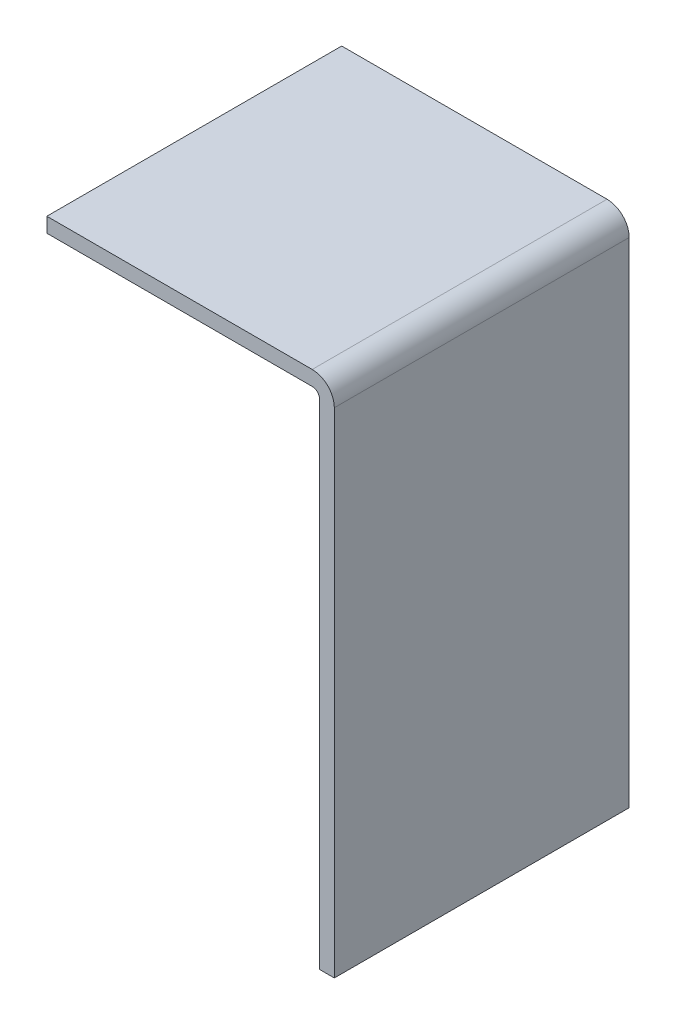
ISO-10303-21;
HEADER;
FILE_DESCRIPTION(('STEP AP214'),'2;1');
FILE_NAME('part.step','',(''),(''),'','','');
FILE_SCHEMA(('AUTOMOTIVE_DESIGN { 1 0 10303 214 1 1 1 1 }'));
ENDSEC;
DATA;
#1=APPLICATION_CONTEXT('core data for automotive mechanical design processes');
#2=APPLICATION_PROTOCOL_DEFINITION('international standard','automotive_design',2000,#1);
#3=PRODUCT_CONTEXT('',#1,'mechanical');
#4=PRODUCT('Part','Part','',(#3));
#5=PRODUCT_RELATED_PRODUCT_CATEGORY('part','',(#4));
#6=PRODUCT_DEFINITION_FORMATION('','',#4);
#7=PRODUCT_DEFINITION_CONTEXT('part definition',#1,'design');
#8=PRODUCT_DEFINITION('design','',#6,#7);
#9=PRODUCT_DEFINITION_SHAPE('','',#8);
#10=(LENGTH_UNIT() NAMED_UNIT(*) SI_UNIT(.MILLI.,.METRE.));
#11=(NAMED_UNIT(*) PLANE_ANGLE_UNIT() SI_UNIT($,.RADIAN.));
#12=(NAMED_UNIT(*) SI_UNIT($,.STERADIAN.) SOLID_ANGLE_UNIT());
#13=UNCERTAINTY_MEASURE_WITH_UNIT(LENGTH_MEASURE(1.E-05),#10,'distance_accuracy_value','');
#14=(GEOMETRIC_REPRESENTATION_CONTEXT(3) GLOBAL_UNCERTAINTY_ASSIGNED_CONTEXT((#13)) GLOBAL_UNIT_ASSIGNED_CONTEXT((#10,
#11,#12)) REPRESENTATION_CONTEXT('',''));
#15=CARTESIAN_POINT('',(0.,0.,0.));
#16=DIRECTION('',(0.,0.,1.));
#17=DIRECTION('',(1.,0.,0.));
#18=AXIS2_PLACEMENT_3D('',#15,#16,#17);
#19=CARTESIAN_POINT('',(-39.,0.,40.));
#20=DIRECTION('',(1.,0.,0.));
#21=DIRECTION('',(0.,0.,-1.));
#22=AXIS2_PLACEMENT_3D('',#19,#20,#21);
#23=PLANE('',#22);
#24=DIRECTION('',(0.,-1.,0.));
#25=VECTOR('',#24,1.);
#26=CARTESIAN_POINT('',(-39.,0.,0.));
#27=LINE('',#26,#25);
#28=CARTESIAN_POINT('',(-39.,0.,0.));
#29=VERTEX_POINT('',#28);
#30=CARTESIAN_POINT('',(-39.,-2.,0.));
#31=VERTEX_POINT('',#30);
#32=EDGE_CURVE('E127',#29,#31,#27,.T.);
#33=ORIENTED_EDGE('',*,*,#32,.T.);
#34=DIRECTION('',(0.,0.,-1.));
#35=VECTOR('',#34,1.);
#36=CARTESIAN_POINT('',(-39.,-2.,40.));
#37=LINE('',#36,#35);
#38=CARTESIAN_POINT('',(-39.,-2.,40.));
#39=VERTEX_POINT('',#38);
#40=EDGE_CURVE('E11',#39,#31,#37,.T.);
#41=ORIENTED_EDGE('',*,*,#40,.F.);
#42=DIRECTION('',(0.,-1.,0.));
#43=VECTOR('',#42,1.);
#44=CARTESIAN_POINT('',(-39.,0.,40.));
#45=LINE('',#44,#43);
#46=CARTESIAN_POINT('',(-39.,0.,40.));
#47=VERTEX_POINT('',#46);
#48=EDGE_CURVE('E141',#47,#39,#45,.T.);
#49=ORIENTED_EDGE('',*,*,#48,.F.);
#50=DIRECTION('',(0.,0.,-1.));
#51=VECTOR('',#50,1.);
#52=CARTESIAN_POINT('',(-39.,0.,40.));
#53=LINE('',#52,#51);
#54=EDGE_CURVE('E123',#47,#29,#53,.T.);
#55=ORIENTED_EDGE('',*,*,#54,.T.);
#56=EDGE_LOOP('',(#33,#41,#49,#55));
#57=FACE_BOUND('',#56,.T.);
#58=ADVANCED_FACE('F31',(#57),#23,.F.);
#59=CARTESIAN_POINT('',(-3.00000000000001,-2.,40.));
#60=DIRECTION('',(0.,1.,0.));
#61=DIRECTION('',(0.,0.,1.));
#62=AXIS2_PLACEMENT_3D('',#59,#60,#61);
#63=PLANE('',#62);
#64=DIRECTION('',(1.,0.,0.));
#65=VECTOR('',#64,1.);
#66=CARTESIAN_POINT('',(-3.00000000000001,-2.,0.));
#67=LINE('',#66,#65);
#68=CARTESIAN_POINT('',(-3.00000000000001,-2.,0.));
#69=VERTEX_POINT('',#68);
#70=EDGE_CURVE('E130',#31,#69,#67,.T.);
#71=ORIENTED_EDGE('',*,*,#70,.T.);
#72=DIRECTION('',(0.,0.,-1.));
#73=VECTOR('',#72,1.);
#74=CARTESIAN_POINT('',(-3.00000000000001,-2.,40.));
#75=LINE('',#74,#73);
#76=CARTESIAN_POINT('',(-3.00000000000001,-2.,40.));
#77=VERTEX_POINT('',#76);
#78=EDGE_CURVE('E39',#77,#69,#75,.T.);
#79=ORIENTED_EDGE('',*,*,#78,.F.);
#80=DIRECTION('',(1.,0.,0.));
#81=VECTOR('',#80,1.);
#82=CARTESIAN_POINT('',(-3.00000000000001,-2.,40.));
#83=LINE('',#82,#81);
#84=EDGE_CURVE('E90',#39,#77,#83,.T.);
#85=ORIENTED_EDGE('',*,*,#84,.F.);
#86=ORIENTED_EDGE('',*,*,#40,.T.);
#87=EDGE_LOOP('',(#71,#79,#85,#86));
#88=FACE_BOUND('',#87,.T.);
#89=ADVANCED_FACE('F176',(#88),#63,.F.);
#90=CARTESIAN_POINT('',(-3.,-3.,40.));
#91=DIRECTION('',(0.,0.,-1.));
#92=DIRECTION('',(-1.,0.,0.));
#93=AXIS2_PLACEMENT_3D('',#90,#91,#92);
#94=CYLINDRICAL_SURFACE('',#93,1.);
#95=CARTESIAN_POINT('',(-3.,-3.,0.));
#96=DIRECTION('',(0.,0.,-1.));
#97=DIRECTION('',(-1.,0.,0.));
#98=AXIS2_PLACEMENT_3D('',#95,#96,#97);
#99=CIRCLE('',#98,1.);
#100=CARTESIAN_POINT('',(-2.,-3.00000000000001,0.));
#101=VERTEX_POINT('',#100);
#102=EDGE_CURVE('E132',#69,#101,#99,.T.);
#103=ORIENTED_EDGE('',*,*,#102,.T.);
#104=DIRECTION('',(0.,0.,-1.));
#105=VECTOR('',#104,1.);
#106=CARTESIAN_POINT('',(-2.,-3.00000000000001,40.));
#107=LINE('',#106,#105);
#108=CARTESIAN_POINT('',(-2.,-3.00000000000001,40.));
#109=VERTEX_POINT('',#108);
#110=EDGE_CURVE('E148',#109,#101,#107,.T.);
#111=ORIENTED_EDGE('',*,*,#110,.F.);
#112=CARTESIAN_POINT('',(-3.,-3.,40.));
#113=DIRECTION('',(0.,0.,-1.));
#114=DIRECTION('',(-1.,0.,0.));
#115=AXIS2_PLACEMENT_3D('',#112,#113,#114);
#116=CIRCLE('',#115,1.);
#117=EDGE_CURVE('E156',#77,#109,#116,.T.);
#118=ORIENTED_EDGE('',*,*,#117,.F.);
#119=ORIENTED_EDGE('',*,*,#78,.T.);
#120=EDGE_LOOP('',(#103,#111,#118,#119));
#121=FACE_BOUND('',#120,.T.);
#122=ADVANCED_FACE('F154',(#121),#94,.F.);
#123=CARTESIAN_POINT('',(-2.,-3.00000000000001,40.));
#124=DIRECTION('',(1.,0.,0.));
#125=DIRECTION('',(0.,0.,-1.));
#126=AXIS2_PLACEMENT_3D('',#123,#124,#125);
#127=PLANE('',#126);
#128=DIRECTION('',(0.,-1.,0.));
#129=VECTOR('',#128,1.);
#130=CARTESIAN_POINT('',(-2.,-3.00000000000001,0.));
#131=LINE('',#130,#129);
#132=CARTESIAN_POINT('',(-2.,-70.,0.));
#133=VERTEX_POINT('',#132);
#134=EDGE_CURVE('E134',#101,#133,#131,.T.);
#135=ORIENTED_EDGE('',*,*,#134,.T.);
#136=DIRECTION('',(0.,0.,-1.));
#137=VECTOR('',#136,1.);
#138=CARTESIAN_POINT('',(-2.,-70.,40.));
#139=LINE('',#138,#137);
#140=CARTESIAN_POINT('',(-2.,-70.,40.));
#141=VERTEX_POINT('',#140);
#142=EDGE_CURVE('E145',#141,#133,#139,.T.);
#143=ORIENTED_EDGE('',*,*,#142,.F.);
#144=DIRECTION('',(0.,-1.,0.));
#145=VECTOR('',#144,1.);
#146=CARTESIAN_POINT('',(-2.,-3.00000000000001,40.));
#147=LINE('',#146,#145);
#148=EDGE_CURVE('E168',#109,#141,#147,.T.);
#149=ORIENTED_EDGE('',*,*,#148,.F.);
#150=ORIENTED_EDGE('',*,*,#110,.T.);
#151=EDGE_LOOP('',(#135,#143,#149,#150));
#152=FACE_BOUND('',#151,.T.);
#153=ADVANCED_FACE('F164',(#152),#127,.F.);
#154=CARTESIAN_POINT('',(-2.,-70.,40.));
#155=DIRECTION('',(0.,1.,0.));
#156=DIRECTION('',(0.,0.,1.));
#157=AXIS2_PLACEMENT_3D('',#154,#155,#156);
#158=PLANE('',#157);
#159=DIRECTION('',(1.,0.,0.));
#160=VECTOR('',#159,1.);
#161=CARTESIAN_POINT('',(-2.,-70.,0.));
#162=LINE('',#161,#160);
#163=CARTESIAN_POINT('',(0.,-70.,0.));
#164=VERTEX_POINT('',#163);
#165=EDGE_CURVE('E136',#133,#164,#162,.T.);
#166=ORIENTED_EDGE('',*,*,#165,.T.);
#167=DIRECTION('',(0.,0.,-1.));
#168=VECTOR('',#167,1.);
#169=CARTESIAN_POINT('',(0.,-70.,40.));
#170=LINE('',#169,#168);
#171=CARTESIAN_POINT('',(0.,-70.,40.));
#172=VERTEX_POINT('',#171);
#173=EDGE_CURVE('E118',#172,#164,#170,.T.);
#174=ORIENTED_EDGE('',*,*,#173,.F.);
#175=DIRECTION('',(1.,0.,0.));
#176=VECTOR('',#175,1.);
#177=CARTESIAN_POINT('',(-2.,-70.,40.));
#178=LINE('',#177,#176);
#179=EDGE_CURVE('E109',#141,#172,#178,.T.);
#180=ORIENTED_EDGE('',*,*,#179,.F.);
#181=ORIENTED_EDGE('',*,*,#142,.T.);
#182=EDGE_LOOP('',(#166,#174,#180,#181));
#183=FACE_BOUND('',#182,.T.);
#184=ADVANCED_FACE('F167',(#183),#158,.F.);
#185=CARTESIAN_POINT('',(0.,-3.00000000000002,40.));
#186=DIRECTION('',(-1.,0.,0.));
#187=DIRECTION('',(0.,-1.,0.));
#188=AXIS2_PLACEMENT_3D('',#185,#186,#187);
#189=PLANE('',#188);
#190=DIRECTION('',(0.,1.,0.));
#191=VECTOR('',#190,1.);
#192=CARTESIAN_POINT('',(0.,-3.00000000000002,0.));
#193=LINE('',#192,#191);
#194=CARTESIAN_POINT('',(0.,-3.00000000000002,0.));
#195=VERTEX_POINT('',#194);
#196=EDGE_CURVE('E117',#164,#195,#193,.T.);
#197=ORIENTED_EDGE('',*,*,#196,.T.);
#198=DIRECTION('',(0.,0.,-1.));
#199=VECTOR('',#198,1.);
#200=CARTESIAN_POINT('',(0.,-3.00000000000002,40.));
#201=LINE('',#200,#199);
#202=CARTESIAN_POINT('',(0.,-3.00000000000002,40.));
#203=VERTEX_POINT('',#202);
#204=EDGE_CURVE('E114',#203,#195,#201,.T.);
#205=ORIENTED_EDGE('',*,*,#204,.F.);
#206=DIRECTION('',(0.,1.,0.));
#207=VECTOR('',#206,1.);
#208=CARTESIAN_POINT('',(0.,-3.00000000000002,40.));
#209=LINE('',#208,#207);
#210=EDGE_CURVE('E103',#172,#203,#209,.T.);
#211=ORIENTED_EDGE('',*,*,#210,.F.);
#212=ORIENTED_EDGE('',*,*,#173,.T.);
#213=EDGE_LOOP('',(#197,#205,#211,#212));
#214=FACE_BOUND('',#213,.T.);
#215=ADVANCED_FACE('F115',(#214),#189,.F.);
#216=CARTESIAN_POINT('',(-3.,-3.,40.));
#217=DIRECTION('',(0.,0.,-1.));
#218=DIRECTION('',(-1.,0.,0.));
#219=AXIS2_PLACEMENT_3D('',#216,#217,#218);
#220=CYLINDRICAL_SURFACE('',#219,3.);
#221=CARTESIAN_POINT('',(-3.,-3.,0.));
#222=DIRECTION('',(0.,0.,1.));
#223=DIRECTION('',(1.,0.,0.));
#224=AXIS2_PLACEMENT_3D('',#221,#222,#223);
#225=CIRCLE('',#224,3.);
#226=CARTESIAN_POINT('',(-3.00000000000002,0.,0.));
#227=VERTEX_POINT('',#226);
#228=EDGE_CURVE('E76',#195,#227,#225,.T.);
#229=ORIENTED_EDGE('',*,*,#228,.T.);
#230=DIRECTION('',(0.,0.,-1.));
#231=VECTOR('',#230,1.);
#232=CARTESIAN_POINT('',(-3.00000000000002,0.,40.));
#233=LINE('',#232,#231);
#234=CARTESIAN_POINT('',(-3.00000000000002,0.,40.));
#235=VERTEX_POINT('',#234);
#236=EDGE_CURVE('E119',#235,#227,#233,.T.);
#237=ORIENTED_EDGE('',*,*,#236,.F.);
#238=CARTESIAN_POINT('',(-3.,-3.,40.));
#239=DIRECTION('',(0.,0.,1.));
#240=DIRECTION('',(1.,0.,0.));
#241=AXIS2_PLACEMENT_3D('',#238,#239,#240);
#242=CIRCLE('',#241,3.);
#243=EDGE_CURVE('E107',#203,#235,#242,.T.);
#244=ORIENTED_EDGE('',*,*,#243,.F.);
#245=ORIENTED_EDGE('',*,*,#204,.T.);
#246=EDGE_LOOP('',(#229,#237,#244,#245));
#247=FACE_BOUND('',#246,.T.);
#248=ADVANCED_FACE('F121',(#247),#220,.T.);
#249=CARTESIAN_POINT('',(-3.00000000000002,0.,40.));
#250=DIRECTION('',(0.,-1.,0.));
#251=DIRECTION('',(1.,0.,0.));
#252=AXIS2_PLACEMENT_3D('',#249,#250,#251);
#253=PLANE('',#252);
#254=DIRECTION('',(-1.,0.,0.));
#255=VECTOR('',#254,1.);
#256=CARTESIAN_POINT('',(-3.00000000000002,0.,0.));
#257=LINE('',#256,#255);
#258=EDGE_CURVE('E82',#227,#29,#257,.T.);
#259=ORIENTED_EDGE('',*,*,#258,.T.);
#260=ORIENTED_EDGE('',*,*,#54,.F.);
#261=DIRECTION('',(-1.,0.,0.));
#262=VECTOR('',#261,1.);
#263=CARTESIAN_POINT('',(-3.00000000000002,0.,40.));
#264=LINE('',#263,#262);
#265=EDGE_CURVE('E47',#235,#47,#264,.T.);
#266=ORIENTED_EDGE('',*,*,#265,.F.);
#267=ORIENTED_EDGE('',*,*,#236,.T.);
#268=EDGE_LOOP('',(#259,#260,#266,#267));
#269=FACE_BOUND('',#268,.T.);
#270=ADVANCED_FACE('F192',(#269),#253,.F.);
#271=CARTESIAN_POINT('',(-3.,-3.,40.));
#272=DIRECTION('',(0.,0.,-1.));
#273=DIRECTION('',(-1.,0.,0.));
#274=AXIS2_PLACEMENT_3D('',#271,#272,#273);
#275=PLANE('',#274);
#276=ORIENTED_EDGE('',*,*,#48,.T.);
#277=ORIENTED_EDGE('',*,*,#84,.T.);
#278=ORIENTED_EDGE('',*,*,#117,.T.);
#279=ORIENTED_EDGE('',*,*,#148,.T.);
#280=ORIENTED_EDGE('',*,*,#179,.T.);
#281=ORIENTED_EDGE('',*,*,#210,.T.);
#282=ORIENTED_EDGE('',*,*,#243,.T.);
#283=ORIENTED_EDGE('',*,*,#265,.T.);
#284=EDGE_LOOP('',(#276,#277,#278,#279,#280,#281,#282,#283));
#285=FACE_BOUND('',#284,.T.);
#286=ADVANCED_FACE('F105',(#285),#275,.F.);
#287=CARTESIAN_POINT('',(-3.,-3.,0.));
#288=DIRECTION('',(0.,0.,-1.));
#289=DIRECTION('',(-1.,0.,0.));
#290=AXIS2_PLACEMENT_3D('',#287,#288,#289);
#291=PLANE('',#290);
#292=ORIENTED_EDGE('',*,*,#32,.F.);
#293=ORIENTED_EDGE('',*,*,#258,.F.);
#294=ORIENTED_EDGE('',*,*,#228,.F.);
#295=ORIENTED_EDGE('',*,*,#196,.F.);
#296=ORIENTED_EDGE('',*,*,#165,.F.);
#297=ORIENTED_EDGE('',*,*,#134,.F.);
#298=ORIENTED_EDGE('',*,*,#102,.F.);
#299=ORIENTED_EDGE('',*,*,#70,.F.);
#300=EDGE_LOOP('',(#292,#293,#294,#295,#296,#297,#298,#299));
#301=FACE_BOUND('',#300,.T.);
#302=ADVANCED_FACE('F160',(#301),#291,.T.);
#303=CLOSED_SHELL('',(#58,#89,#122,#153,#184,#215,#248,#270,#286,#302));
#304=MANIFOLD_SOLID_BREP('B2',#303);
#305=ADVANCED_BREP_SHAPE_REPRESENTATION('',(#18,#304),#14);
#306=SHAPE_DEFINITION_REPRESENTATION(#9,#305);
ENDSEC;
END-ISO-10303-21;
